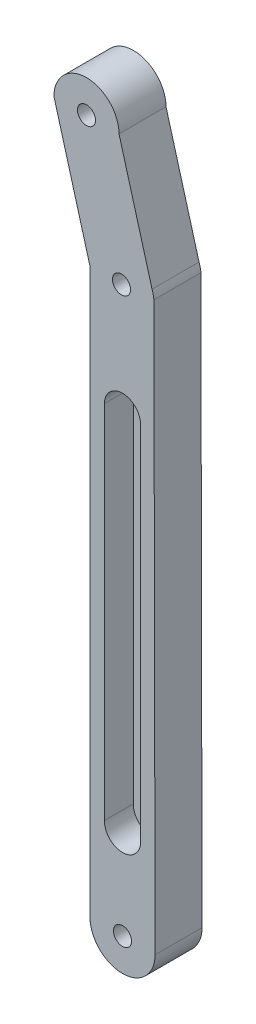
ISO-10303-21;
HEADER;
FILE_DESCRIPTION(('STEP AP214'),'2;1');
FILE_NAME('part.step','',(''),(''),'','','');
FILE_SCHEMA(('AUTOMOTIVE_DESIGN { 1 0 10303 214 1 1 1 1 }'));
ENDSEC;
DATA;
#1=APPLICATION_CONTEXT('core data for automotive mechanical design processes');
#2=APPLICATION_PROTOCOL_DEFINITION('international standard','automotive_design',2000,#1);
#3=PRODUCT_CONTEXT('',#1,'mechanical');
#4=PRODUCT('Part','Part','',(#3));
#5=PRODUCT_RELATED_PRODUCT_CATEGORY('part','',(#4));
#6=PRODUCT_DEFINITION_FORMATION('','',#4);
#7=PRODUCT_DEFINITION_CONTEXT('part definition',#1,'design');
#8=PRODUCT_DEFINITION('design','',#6,#7);
#9=PRODUCT_DEFINITION_SHAPE('','',#8);
#10=(LENGTH_UNIT() NAMED_UNIT(*) SI_UNIT(.MILLI.,.METRE.));
#11=(NAMED_UNIT(*) PLANE_ANGLE_UNIT() SI_UNIT($,.RADIAN.));
#12=(NAMED_UNIT(*) SI_UNIT($,.STERADIAN.) SOLID_ANGLE_UNIT());
#13=UNCERTAINTY_MEASURE_WITH_UNIT(LENGTH_MEASURE(1.E-05),#10,'distance_accuracy_value','');
#14=(GEOMETRIC_REPRESENTATION_CONTEXT(3) GLOBAL_UNCERTAINTY_ASSIGNED_CONTEXT((#13)) GLOBAL_UNIT_ASSIGNED_CONTEXT((#10,
#11,#12)) REPRESENTATION_CONTEXT('',''));
#15=CARTESIAN_POINT('',(0.,0.,0.));
#16=DIRECTION('',(0.,0.,1.));
#17=DIRECTION('',(1.,0.,0.));
#18=AXIS2_PLACEMENT_3D('',#15,#16,#17);
#19=CARTESIAN_POINT('',(-12.0849340363572,148.987312466072,13.));
#20=DIRECTION('',(0.,0.,1.));
#21=DIRECTION('',(1.,0.,0.));
#22=AXIS2_PLACEMENT_3D('',#19,#20,#21);
#23=PLANE('',#22);
#24=CARTESIAN_POINT('',(-2.11461561853498,82.3636914419414,13.));
#25=DIRECTION('',(0.,0.,1.));
#26=DIRECTION('',(1.,0.,0.));
#27=AXIS2_PLACEMENT_3D('',#24,#25,#26);
#28=CIRCLE('',#27,5.);
#29=CARTESIAN_POINT('',(2.88538438146502,82.3636914419414,13.));
#30=VERTEX_POINT('',#29);
#31=CARTESIAN_POINT('',(-7.11461561853498,82.3636914419414,13.));
#32=VERTEX_POINT('',#31);
#33=EDGE_CURVE('E46',#30,#32,#28,.T.);
#34=ORIENTED_EDGE('',*,*,#33,.F.);
#35=DIRECTION('',(0.000571960577738296,0.999999836430535,0.));
#36=VECTOR('',#35,1.);
#37=CARTESIAN_POINT('',(2.88538438146502,82.3636914419414,13.));
#38=LINE('',#37,#36);
#39=CARTESIAN_POINT('',(2.82861802437657,-16.8850155715431,13.));
#40=VERTEX_POINT('',#39);
#41=EDGE_CURVE('E200',#40,#30,#38,.T.);
#42=ORIENTED_EDGE('',*,*,#41,.F.);
#43=CARTESIAN_POINT('',(-2.11461561853498,-17.6363085580586,13.));
#44=DIRECTION('',(0.,0.,1.));
#45=DIRECTION('',(1.,0.,0.));
#46=AXIS2_PLACEMENT_3D('',#43,#44,#45);
#47=CIRCLE('',#46,5.);
#48=CARTESIAN_POINT('',(-7.11208071176572,-17.4771148334957,13.));
#49=VERTEX_POINT('',#48);
#50=EDGE_CURVE('E204',#49,#40,#47,.T.);
#51=ORIENTED_EDGE('',*,*,#50,.F.);
#52=DIRECTION('',(2.53894861530553E-05,-0.999999999677687,0.));
#53=VECTOR('',#52,1.);
#54=CARTESIAN_POINT('',(-7.11461561853498,82.3636914419414,13.));
#55=LINE('',#54,#53);
#56=EDGE_CURVE('E207',#32,#49,#55,.T.);
#57=ORIENTED_EDGE('',*,*,#56,.F.);
#58=EDGE_LOOP('',(#34,#42,#51,#57));
#59=FACE_BOUND('',#58,.T.);
#60=CARTESIAN_POINT('',(-2.11461561853496,-42.6363085580586,13.));
#61=DIRECTION('',(0.,0.,1.));
#62=DIRECTION('',(1.,0.,0.));
#63=AXIS2_PLACEMENT_3D('',#60,#61,#62);
#64=CIRCLE('',#63,2.5);
#65=CARTESIAN_POINT('',(0.385384381465048,-42.6363085580586,13.));
#66=VERTEX_POINT('',#65);
#67=EDGE_CURVE('E175',#66,#66,#64,.T.);
#68=ORIENTED_EDGE('',*,*,#67,.F.);
#69=EDGE_LOOP('',(#68));
#70=FACE_BOUND('',#69,.T.);
#71=DIRECTION('',(0.268918327495868,-0.963162983682837,0.));
#72=VECTOR('',#71,1.);
#73=CARTESIAN_POINT('',(-11.114615618535,113.277430863729,13.));
#74=LINE('',#73,#72);
#75=CARTESIAN_POINT('',(-21.0849340363572,148.987312466072,13.));
#76=VERTEX_POINT('',#75);
#77=CARTESIAN_POINT('',(-11.114615618535,113.277430863729,13.));
#78=VERTEX_POINT('',#77);
#79=EDGE_CURVE('E148',#76,#78,#74,.T.);
#80=ORIENTED_EDGE('',*,*,#79,.T.);
#81=DIRECTION('',(0.,-1.,0.));
#82=VECTOR('',#81,1.);
#83=CARTESIAN_POINT('',(-11.114615618535,113.277430863729,13.));
#84=LINE('',#83,#82);
#85=CARTESIAN_POINT('',(-11.114615618535,-42.6363085580586,13.));
#86=VERTEX_POINT('',#85);
#87=EDGE_CURVE('E93',#78,#86,#84,.T.);
#88=ORIENTED_EDGE('',*,*,#87,.T.);
#89=CARTESIAN_POINT('',(-2.11461561853496,-42.6363085580586,13.));
#90=DIRECTION('',(0.,0.,1.));
#91=DIRECTION('',(1.,0.,0.));
#92=AXIS2_PLACEMENT_3D('',#89,#90,#91);
#93=CIRCLE('',#92,9.);
#94=CARTESIAN_POINT('',(6.88538438146504,-42.6363085580586,13.));
#95=VERTEX_POINT('',#94);
#96=EDGE_CURVE('E160',#86,#95,#93,.T.);
#97=ORIENTED_EDGE('',*,*,#96,.T.);
#98=DIRECTION('',(-0.00204369502849195,0.999997911653135,0.));
#99=VECTOR('',#98,1.);
#100=CARTESIAN_POINT('',(6.88538438146504,-42.6363085580586,13.));
#101=LINE('',#100,#99);
#102=CARTESIAN_POINT('',(6.56511811579736,114.072785693132,13.));
#103=VERTEX_POINT('',#102);
#104=EDGE_CURVE('E113',#95,#103,#101,.T.);
#105=ORIENTED_EDGE('',*,*,#104,.T.);
#106=CARTESIAN_POINT('',(-2.39966914856901,113.277430863729,13.));
#107=DIRECTION('',(0.,0.,1.));
#108=DIRECTION('',(1.,0.,0.));
#109=AXIS2_PLACEMENT_3D('',#106,#107,#108);
#110=CIRCLE('',#109,9.);
#111=CARTESIAN_POINT('',(6.05371091603838,116.366179070252,13.));
#112=VERTEX_POINT('',#111);
#113=EDGE_CURVE('E106',#103,#112,#110,.T.);
#114=ORIENTED_EDGE('',*,*,#113,.T.);
#115=DIRECTION('',(-0.269759329456065,0.962927777235351,0.));
#116=VECTOR('',#115,1.);
#117=CARTESIAN_POINT('',(6.05371091603838,116.366179070252,13.));
#118=LINE('',#117,#116);
#119=CARTESIAN_POINT('',(-3.08493403635723,148.987312466072,13.));
#120=VERTEX_POINT('',#119);
#121=EDGE_CURVE('E110',#112,#120,#118,.T.);
#122=ORIENTED_EDGE('',*,*,#121,.T.);
#123=CARTESIAN_POINT('',(-12.0849340363572,148.987312466072,13.));
#124=DIRECTION('',(0.,0.,1.));
#125=DIRECTION('',(1.,0.,0.));
#126=AXIS2_PLACEMENT_3D('',#123,#124,#125);
#127=CIRCLE('',#126,9.);
#128=EDGE_CURVE('E55',#120,#76,#127,.T.);
#129=ORIENTED_EDGE('',*,*,#128,.T.);
#130=EDGE_LOOP('',(#80,#88,#97,#105,#114,#122,#129));
#131=FACE_BOUND('',#130,.T.);
#132=CARTESIAN_POINT('',(-2.39966914856901,113.277430863729,13.));
#133=DIRECTION('',(0.,0.,1.));
#134=DIRECTION('',(1.,0.,0.));
#135=AXIS2_PLACEMENT_3D('',#132,#133,#134);
#136=CIRCLE('',#135,2.5);
#137=CARTESIAN_POINT('',(0.100330851430995,113.277430863729,13.));
#138=VERTEX_POINT('',#137);
#139=EDGE_CURVE('E138',#138,#138,#136,.T.);
#140=ORIENTED_EDGE('',*,*,#139,.F.);
#141=EDGE_LOOP('',(#140));
#142=FACE_BOUND('',#141,.T.);
#143=CARTESIAN_POINT('',(-12.0849340363572,148.987312466072,13.));
#144=DIRECTION('',(0.,0.,1.));
#145=DIRECTION('',(1.,0.,0.));
#146=AXIS2_PLACEMENT_3D('',#143,#144,#145);
#147=CIRCLE('',#146,2.5);
#148=CARTESIAN_POINT('',(-9.58493403635723,148.987312466072,13.));
#149=VERTEX_POINT('',#148);
#150=EDGE_CURVE('E181',#149,#149,#147,.T.);
#151=ORIENTED_EDGE('',*,*,#150,.F.);
#152=EDGE_LOOP('',(#151));
#153=FACE_BOUND('',#152,.T.);
#154=ADVANCED_FACE('F31',(#59,#70,#131,#142,#153),#23,.T.);
#155=CARTESIAN_POINT('',(-12.0849340363572,148.987312466072,0.));
#156=DIRECTION('',(0.,0.,1.));
#157=DIRECTION('',(1.,0.,0.));
#158=AXIS2_PLACEMENT_3D('',#155,#156,#157);
#159=PLANE('',#158);
#160=CARTESIAN_POINT('',(-2.11461561853496,-42.6363085580586,0.));
#161=DIRECTION('',(0.,0.,1.));
#162=DIRECTION('',(1.,0.,0.));
#163=AXIS2_PLACEMENT_3D('',#160,#161,#162);
#164=CIRCLE('',#163,2.5);
#165=CARTESIAN_POINT('',(0.385384381465048,-42.6363085580586,0.));
#166=VERTEX_POINT('',#165);
#167=EDGE_CURVE('E178',#166,#166,#164,.T.);
#168=ORIENTED_EDGE('',*,*,#167,.T.);
#169=EDGE_LOOP('',(#168));
#170=FACE_BOUND('',#169,.T.);
#171=DIRECTION('',(0.268918327495868,-0.963162983682837,0.));
#172=VECTOR('',#171,1.);
#173=CARTESIAN_POINT('',(-11.114615618535,113.277430863729,0.));
#174=LINE('',#173,#172);
#175=CARTESIAN_POINT('',(-21.0849340363572,148.987312466072,0.));
#176=VERTEX_POINT('',#175);
#177=CARTESIAN_POINT('',(-11.114615618535,113.277430863729,0.));
#178=VERTEX_POINT('',#177);
#179=EDGE_CURVE('E134',#176,#178,#174,.T.);
#180=ORIENTED_EDGE('',*,*,#179,.F.);
#181=CARTESIAN_POINT('',(-12.0849340363572,148.987312466072,0.));
#182=DIRECTION('',(0.,0.,1.));
#183=DIRECTION('',(1.,0.,0.));
#184=AXIS2_PLACEMENT_3D('',#181,#182,#183);
#185=CIRCLE('',#184,9.);
#186=CARTESIAN_POINT('',(-3.08493403635723,148.987312466072,0.));
#187=VERTEX_POINT('',#186);
#188=EDGE_CURVE('E85',#187,#176,#185,.T.);
#189=ORIENTED_EDGE('',*,*,#188,.F.);
#190=DIRECTION('',(-0.269759329456065,0.962927777235351,0.));
#191=VECTOR('',#190,1.);
#192=CARTESIAN_POINT('',(6.05371091603838,116.366179070252,0.));
#193=LINE('',#192,#191);
#194=CARTESIAN_POINT('',(6.05371091603838,116.366179070252,0.));
#195=VERTEX_POINT('',#194);
#196=EDGE_CURVE('E145',#195,#187,#193,.T.);
#197=ORIENTED_EDGE('',*,*,#196,.F.);
#198=CARTESIAN_POINT('',(-2.39966914856901,113.277430863729,0.));
#199=DIRECTION('',(0.,0.,1.));
#200=DIRECTION('',(1.,0.,0.));
#201=AXIS2_PLACEMENT_3D('',#198,#199,#200);
#202=CIRCLE('',#201,9.);
#203=CARTESIAN_POINT('',(6.56511811579736,114.072785693132,0.));
#204=VERTEX_POINT('',#203);
#205=EDGE_CURVE('E122',#204,#195,#202,.T.);
#206=ORIENTED_EDGE('',*,*,#205,.F.);
#207=DIRECTION('',(-0.00204369502849195,0.999997911653135,0.));
#208=VECTOR('',#207,1.);
#209=CARTESIAN_POINT('',(6.88538438146504,-42.6363085580586,0.));
#210=LINE('',#209,#208);
#211=CARTESIAN_POINT('',(6.88538438146504,-42.6363085580586,0.));
#212=VERTEX_POINT('',#211);
#213=EDGE_CURVE('E142',#212,#204,#210,.T.);
#214=ORIENTED_EDGE('',*,*,#213,.F.);
#215=CARTESIAN_POINT('',(-2.11461561853496,-42.6363085580586,0.));
#216=DIRECTION('',(0.,0.,1.));
#217=DIRECTION('',(1.,0.,0.));
#218=AXIS2_PLACEMENT_3D('',#215,#216,#217);
#219=CIRCLE('',#218,9.);
#220=CARTESIAN_POINT('',(-11.114615618535,-42.6363085580586,0.));
#221=VERTEX_POINT('',#220);
#222=EDGE_CURVE('E140',#221,#212,#219,.T.);
#223=ORIENTED_EDGE('',*,*,#222,.F.);
#224=DIRECTION('',(0.,-1.,0.));
#225=VECTOR('',#224,1.);
#226=CARTESIAN_POINT('',(-11.114615618535,113.277430863729,0.));
#227=LINE('',#226,#225);
#228=EDGE_CURVE('E137',#178,#221,#227,.T.);
#229=ORIENTED_EDGE('',*,*,#228,.F.);
#230=EDGE_LOOP('',(#180,#189,#197,#206,#214,#223,#229));
#231=FACE_BOUND('',#230,.T.);
#232=CARTESIAN_POINT('',(-2.39966914856901,113.277430863729,0.));
#233=DIRECTION('',(0.,0.,1.));
#234=DIRECTION('',(1.,0.,0.));
#235=AXIS2_PLACEMENT_3D('',#232,#233,#234);
#236=CIRCLE('',#235,2.5);
#237=CARTESIAN_POINT('',(0.100330851430995,113.277430863729,0.));
#238=VERTEX_POINT('',#237);
#239=EDGE_CURVE('E172',#238,#238,#236,.T.);
#240=ORIENTED_EDGE('',*,*,#239,.T.);
#241=EDGE_LOOP('',(#240));
#242=FACE_BOUND('',#241,.T.);
#243=CARTESIAN_POINT('',(-12.0849340363572,148.987312466072,0.));
#244=DIRECTION('',(0.,0.,1.));
#245=DIRECTION('',(1.,0.,0.));
#246=AXIS2_PLACEMENT_3D('',#243,#244,#245);
#247=CIRCLE('',#246,2.5);
#248=CARTESIAN_POINT('',(-9.58493403635723,148.987312466072,0.));
#249=VERTEX_POINT('',#248);
#250=EDGE_CURVE('E184',#249,#249,#247,.T.);
#251=ORIENTED_EDGE('',*,*,#250,.T.);
#252=EDGE_LOOP('',(#251));
#253=FACE_BOUND('',#252,.T.);
#254=ADVANCED_FACE('F164',(#170,#231,#242,#253),#159,.F.);
#255=CARTESIAN_POINT('',(-11.114615618535,113.277430863729,13.));
#256=DIRECTION('',(0.963162983682837,0.268918327495868,0.));
#257=DIRECTION('',(-0.268918327495868,0.963162983682837,0.));
#258=AXIS2_PLACEMENT_3D('',#255,#256,#257);
#259=PLANE('',#258);
#260=ORIENTED_EDGE('',*,*,#179,.T.);
#261=DIRECTION('',(0.,0.,-1.));
#262=VECTOR('',#261,1.);
#263=CARTESIAN_POINT('',(-11.114615618535,113.277430863729,13.));
#264=LINE('',#263,#262);
#265=EDGE_CURVE('E11',#78,#178,#264,.T.);
#266=ORIENTED_EDGE('',*,*,#265,.F.);
#267=ORIENTED_EDGE('',*,*,#79,.F.);
#268=DIRECTION('',(0.,0.,-1.));
#269=VECTOR('',#268,1.);
#270=CARTESIAN_POINT('',(-21.0849340363572,148.987312466072,13.));
#271=LINE('',#270,#269);
#272=EDGE_CURVE('E130',#76,#176,#271,.T.);
#273=ORIENTED_EDGE('',*,*,#272,.T.);
#274=EDGE_LOOP('',(#260,#266,#267,#273));
#275=FACE_BOUND('',#274,.T.);
#276=ADVANCED_FACE('F33',(#275),#259,.F.);
#277=CARTESIAN_POINT('',(-11.114615618535,113.277430863729,13.));
#278=DIRECTION('',(1.,0.,0.));
#279=DIRECTION('',(0.,1.,0.));
#280=AXIS2_PLACEMENT_3D('',#277,#278,#279);
#281=PLANE('',#280);
#282=ORIENTED_EDGE('',*,*,#228,.T.);
#283=DIRECTION('',(0.,0.,-1.));
#284=VECTOR('',#283,1.);
#285=CARTESIAN_POINT('',(-11.114615618535,-42.6363085580586,13.));
#286=LINE('',#285,#284);
#287=EDGE_CURVE('E39',#86,#221,#286,.T.);
#288=ORIENTED_EDGE('',*,*,#287,.F.);
#289=ORIENTED_EDGE('',*,*,#87,.F.);
#290=ORIENTED_EDGE('',*,*,#265,.T.);
#291=EDGE_LOOP('',(#282,#288,#289,#290));
#292=FACE_BOUND('',#291,.T.);
#293=ADVANCED_FACE('F281',(#292),#281,.F.);
#294=CARTESIAN_POINT('',(-2.11461561853496,-42.6363085580586,13.));
#295=DIRECTION('',(0.,0.,-1.));
#296=DIRECTION('',(-1.,0.,0.));
#297=AXIS2_PLACEMENT_3D('',#294,#295,#296);
#298=CYLINDRICAL_SURFACE('',#297,9.);
#299=ORIENTED_EDGE('',*,*,#222,.T.);
#300=DIRECTION('',(0.,0.,-1.));
#301=VECTOR('',#300,1.);
#302=CARTESIAN_POINT('',(6.88538438146504,-42.6363085580586,13.));
#303=LINE('',#302,#301);
#304=EDGE_CURVE('E152',#95,#212,#303,.T.);
#305=ORIENTED_EDGE('',*,*,#304,.F.);
#306=ORIENTED_EDGE('',*,*,#96,.F.);
#307=ORIENTED_EDGE('',*,*,#287,.T.);
#308=EDGE_LOOP('',(#299,#305,#306,#307));
#309=FACE_BOUND('',#308,.T.);
#310=ADVANCED_FACE('F158',(#309),#298,.T.);
#311=CARTESIAN_POINT('',(6.88538438146504,-42.6363085580586,13.));
#312=DIRECTION('',(-0.999997911653135,-0.00204369502849195,0.));
#313=DIRECTION('',(0.00204369502849195,-0.999997911653135,0.));
#314=AXIS2_PLACEMENT_3D('',#311,#312,#313);
#315=PLANE('',#314);
#316=ORIENTED_EDGE('',*,*,#213,.T.);
#317=DIRECTION('',(0.,0.,-1.));
#318=VECTOR('',#317,1.);
#319=CARTESIAN_POINT('',(6.56511811579736,114.072785693132,13.));
#320=LINE('',#319,#318);
#321=EDGE_CURVE('E125',#103,#204,#320,.T.);
#322=ORIENTED_EDGE('',*,*,#321,.F.);
#323=ORIENTED_EDGE('',*,*,#104,.F.);
#324=ORIENTED_EDGE('',*,*,#304,.T.);
#325=EDGE_LOOP('',(#316,#322,#323,#324));
#326=FACE_BOUND('',#325,.T.);
#327=ADVANCED_FACE('F167',(#326),#315,.F.);
#328=CARTESIAN_POINT('',(-2.39966914856901,113.277430863729,13.));
#329=DIRECTION('',(0.,0.,-1.));
#330=DIRECTION('',(-1.,0.,0.));
#331=AXIS2_PLACEMENT_3D('',#328,#329,#330);
#332=CYLINDRICAL_SURFACE('',#331,9.);
#333=ORIENTED_EDGE('',*,*,#205,.T.);
#334=DIRECTION('',(0.,0.,-1.));
#335=VECTOR('',#334,1.);
#336=CARTESIAN_POINT('',(6.05371091603838,116.366179070252,13.));
#337=LINE('',#336,#335);
#338=EDGE_CURVE('E119',#112,#195,#337,.T.);
#339=ORIENTED_EDGE('',*,*,#338,.F.);
#340=ORIENTED_EDGE('',*,*,#113,.F.);
#341=ORIENTED_EDGE('',*,*,#321,.T.);
#342=EDGE_LOOP('',(#333,#339,#340,#341));
#343=FACE_BOUND('',#342,.T.);
#344=ADVANCED_FACE('F120',(#343),#332,.T.);
#345=CARTESIAN_POINT('',(6.05371091603838,116.366179070252,13.));
#346=DIRECTION('',(-0.962927777235351,-0.269759329456065,0.));
#347=DIRECTION('',(0.269759329456065,-0.962927777235351,0.));
#348=AXIS2_PLACEMENT_3D('',#345,#346,#347);
#349=PLANE('',#348);
#350=ORIENTED_EDGE('',*,*,#196,.T.);
#351=DIRECTION('',(0.,0.,-1.));
#352=VECTOR('',#351,1.);
#353=CARTESIAN_POINT('',(-3.08493403635723,148.987312466072,13.));
#354=LINE('',#353,#352);
#355=EDGE_CURVE('E126',#120,#187,#354,.T.);
#356=ORIENTED_EDGE('',*,*,#355,.F.);
#357=ORIENTED_EDGE('',*,*,#121,.F.);
#358=ORIENTED_EDGE('',*,*,#338,.T.);
#359=EDGE_LOOP('',(#350,#356,#357,#358));
#360=FACE_BOUND('',#359,.T.);
#361=ADVANCED_FACE('F128',(#360),#349,.F.);
#362=CARTESIAN_POINT('',(-12.0849340363572,148.987312466072,13.));
#363=DIRECTION('',(0.,0.,-1.));
#364=DIRECTION('',(-1.,0.,0.));
#365=AXIS2_PLACEMENT_3D('',#362,#363,#364);
#366=CYLINDRICAL_SURFACE('',#365,9.);
#367=ORIENTED_EDGE('',*,*,#188,.T.);
#368=ORIENTED_EDGE('',*,*,#272,.F.);
#369=ORIENTED_EDGE('',*,*,#128,.F.);
#370=ORIENTED_EDGE('',*,*,#355,.T.);
#371=EDGE_LOOP('',(#367,#368,#369,#370));
#372=FACE_BOUND('',#371,.T.);
#373=ADVANCED_FACE('F271',(#372),#366,.T.);
#374=CARTESIAN_POINT('',(-2.39966914856901,113.277430863729,13.));
#375=DIRECTION('',(0.,0.,-1.));
#376=DIRECTION('',(-1.,0.,0.));
#377=AXIS2_PLACEMENT_3D('',#374,#375,#376);
#378=CYLINDRICAL_SURFACE('',#377,2.5);
#379=ORIENTED_EDGE('',*,*,#139,.T.);
#380=EDGE_LOOP('',(#379));
#381=FACE_BOUND('',#380,.T.);
#382=ORIENTED_EDGE('',*,*,#239,.F.);
#383=EDGE_LOOP('',(#382));
#384=FACE_BOUND('',#383,.T.);
#385=ADVANCED_FACE('F268',(#381,#384),#378,.F.);
#386=CARTESIAN_POINT('',(-2.11461561853496,-42.6363085580586,13.));
#387=DIRECTION('',(0.,0.,-1.));
#388=DIRECTION('',(-1.,0.,0.));
#389=AXIS2_PLACEMENT_3D('',#386,#387,#388);
#390=CYLINDRICAL_SURFACE('',#389,2.5);
#391=ORIENTED_EDGE('',*,*,#67,.T.);
#392=EDGE_LOOP('',(#391));
#393=FACE_BOUND('',#392,.T.);
#394=ORIENTED_EDGE('',*,*,#167,.F.);
#395=EDGE_LOOP('',(#394));
#396=FACE_BOUND('',#395,.T.);
#397=ADVANCED_FACE('F339',(#393,#396),#390,.F.);
#398=CARTESIAN_POINT('',(-12.0849340363572,148.987312466072,13.));
#399=DIRECTION('',(0.,0.,-1.));
#400=DIRECTION('',(-1.,0.,0.));
#401=AXIS2_PLACEMENT_3D('',#398,#399,#400);
#402=CYLINDRICAL_SURFACE('',#401,2.5);
#403=ORIENTED_EDGE('',*,*,#150,.T.);
#404=EDGE_LOOP('',(#403));
#405=FACE_BOUND('',#404,.T.);
#406=ORIENTED_EDGE('',*,*,#250,.F.);
#407=EDGE_LOOP('',(#406));
#408=FACE_BOUND('',#407,.T.);
#409=ADVANCED_FACE('F347',(#405,#408),#402,.F.);
#410=CARTESIAN_POINT('',(-2.11461561853498,82.3636914419414,5.));
#411=DIRECTION('',(0.,0.,1.));
#412=DIRECTION('',(1.,0.,0.));
#413=AXIS2_PLACEMENT_3D('',#410,#411,#412);
#414=CYLINDRICAL_SURFACE('',#413,5.);
#415=ORIENTED_EDGE('',*,*,#33,.T.);
#416=DIRECTION('',(0.,0.,1.));
#417=VECTOR('',#416,1.);
#418=CARTESIAN_POINT('',(-7.11461561853498,82.3636914419414,5.));
#419=LINE('',#418,#417);
#420=CARTESIAN_POINT('',(-7.11461561853498,82.3636914419414,5.));
#421=VERTEX_POINT('',#420);
#422=EDGE_CURVE('E190',#421,#32,#419,.T.);
#423=ORIENTED_EDGE('',*,*,#422,.F.);
#424=CARTESIAN_POINT('',(-2.11461561853498,82.3636914419414,5.));
#425=DIRECTION('',(0.,0.,1.));
#426=DIRECTION('',(1.,0.,0.));
#427=AXIS2_PLACEMENT_3D('',#424,#425,#426);
#428=CIRCLE('',#427,5.);
#429=CARTESIAN_POINT('',(2.88538438146502,82.3636914419414,5.));
#430=VERTEX_POINT('',#429);
#431=EDGE_CURVE('E203',#430,#421,#428,.T.);
#432=ORIENTED_EDGE('',*,*,#431,.F.);
#433=DIRECTION('',(0.,0.,1.));
#434=VECTOR('',#433,1.);
#435=CARTESIAN_POINT('',(2.88538438146502,82.3636914419414,5.));
#436=LINE('',#435,#434);
#437=EDGE_CURVE('E187',#430,#30,#436,.T.);
#438=ORIENTED_EDGE('',*,*,#437,.T.);
#439=EDGE_LOOP('',(#415,#423,#432,#438));
#440=FACE_BOUND('',#439,.T.);
#441=ADVANCED_FACE('F228',(#440),#414,.F.);
#442=CARTESIAN_POINT('',(2.88538438146502,82.3636914419414,5.));
#443=DIRECTION('',(0.999999836430535,-0.000571960577738296,0.));
#444=DIRECTION('',(0.000571960577738296,0.999999836430535,0.));
#445=AXIS2_PLACEMENT_3D('',#442,#443,#444);
#446=PLANE('',#445);
#447=ORIENTED_EDGE('',*,*,#41,.T.);
#448=ORIENTED_EDGE('',*,*,#437,.F.);
#449=DIRECTION('',(0.000571960577738296,0.999999836430535,0.));
#450=VECTOR('',#449,1.);
#451=CARTESIAN_POINT('',(2.88538438146502,82.3636914419414,5.));
#452=LINE('',#451,#450);
#453=CARTESIAN_POINT('',(2.82861802437657,-16.8850155715431,5.));
#454=VERTEX_POINT('',#453);
#455=EDGE_CURVE('E193',#454,#430,#452,.T.);
#456=ORIENTED_EDGE('',*,*,#455,.F.);
#457=DIRECTION('',(0.,0.,1.));
#458=VECTOR('',#457,1.);
#459=CARTESIAN_POINT('',(2.82861802437657,-16.8850155715431,5.));
#460=LINE('',#459,#458);
#461=EDGE_CURVE('E196',#454,#40,#460,.T.);
#462=ORIENTED_EDGE('',*,*,#461,.T.);
#463=EDGE_LOOP('',(#447,#448,#456,#462));
#464=FACE_BOUND('',#463,.T.);
#465=ADVANCED_FACE('F239',(#464),#446,.F.);
#466=CARTESIAN_POINT('',(-2.11461561853498,-17.6363085580586,5.));
#467=DIRECTION('',(0.,0.,1.));
#468=DIRECTION('',(1.,0.,0.));
#469=AXIS2_PLACEMENT_3D('',#466,#467,#468);
#470=CYLINDRICAL_SURFACE('',#469,5.);
#471=ORIENTED_EDGE('',*,*,#50,.T.);
#472=ORIENTED_EDGE('',*,*,#461,.F.);
#473=CARTESIAN_POINT('',(-2.11461561853498,-17.6363085580586,5.));
#474=DIRECTION('',(0.,0.,1.));
#475=DIRECTION('',(1.,0.,0.));
#476=AXIS2_PLACEMENT_3D('',#473,#474,#475);
#477=CIRCLE('',#476,5.);
#478=CARTESIAN_POINT('',(-7.11208071176572,-17.4771148334957,5.));
#479=VERTEX_POINT('',#478);
#480=EDGE_CURVE('E213',#479,#454,#477,.T.);
#481=ORIENTED_EDGE('',*,*,#480,.F.);
#482=DIRECTION('',(0.,0.,1.));
#483=VECTOR('',#482,1.);
#484=CARTESIAN_POINT('',(-7.11208071176572,-17.4771148334957,5.));
#485=LINE('',#484,#483);
#486=EDGE_CURVE('E192',#479,#49,#485,.T.);
#487=ORIENTED_EDGE('',*,*,#486,.T.);
#488=EDGE_LOOP('',(#471,#472,#481,#487));
#489=FACE_BOUND('',#488,.T.);
#490=ADVANCED_FACE('F244',(#489),#470,.F.);
#491=CARTESIAN_POINT('',(-7.11461561853498,82.3636914419414,5.));
#492=DIRECTION('',(-0.999999999677687,-2.53894861530553E-05,0.));
#493=DIRECTION('',(2.53894861530553E-05,-0.999999999677687,0.));
#494=AXIS2_PLACEMENT_3D('',#491,#492,#493);
#495=PLANE('',#494);
#496=ORIENTED_EDGE('',*,*,#56,.T.);
#497=ORIENTED_EDGE('',*,*,#486,.F.);
#498=DIRECTION('',(2.53894861530553E-05,-0.999999999677687,0.));
#499=VECTOR('',#498,1.);
#500=CARTESIAN_POINT('',(-7.11461561853498,82.3636914419414,5.));
#501=LINE('',#500,#499);
#502=EDGE_CURVE('E216',#421,#479,#501,.T.);
#503=ORIENTED_EDGE('',*,*,#502,.F.);
#504=ORIENTED_EDGE('',*,*,#422,.T.);
#505=EDGE_LOOP('',(#496,#497,#503,#504));
#506=FACE_BOUND('',#505,.T.);
#507=ADVANCED_FACE('F250',(#506),#495,.F.);
#508=CARTESIAN_POINT('',(-2.11461561853498,82.3636914419414,5.));
#509=DIRECTION('',(0.,0.,1.));
#510=DIRECTION('',(1.,0.,0.));
#511=AXIS2_PLACEMENT_3D('',#508,#509,#510);
#512=PLANE('',#511);
#513=ORIENTED_EDGE('',*,*,#431,.T.);
#514=ORIENTED_EDGE('',*,*,#502,.T.);
#515=ORIENTED_EDGE('',*,*,#480,.T.);
#516=ORIENTED_EDGE('',*,*,#455,.T.);
#517=EDGE_LOOP('',(#513,#514,#515,#516));
#518=FACE_BOUND('',#517,.T.);
#519=ADVANCED_FACE('F223',(#518),#512,.T.);
#520=CLOSED_SHELL('',(#154,#254,#276,#293,#310,#327,#344,#361,#373,#385,#397,#409,#441,#465,
#490,#507,#519));
#521=MANIFOLD_SOLID_BREP('B2',#520);
#522=ADVANCED_BREP_SHAPE_REPRESENTATION('',(#18,#521),#14);
#523=SHAPE_DEFINITION_REPRESENTATION(#9,#522);
ENDSEC;
END-ISO-10303-21;
